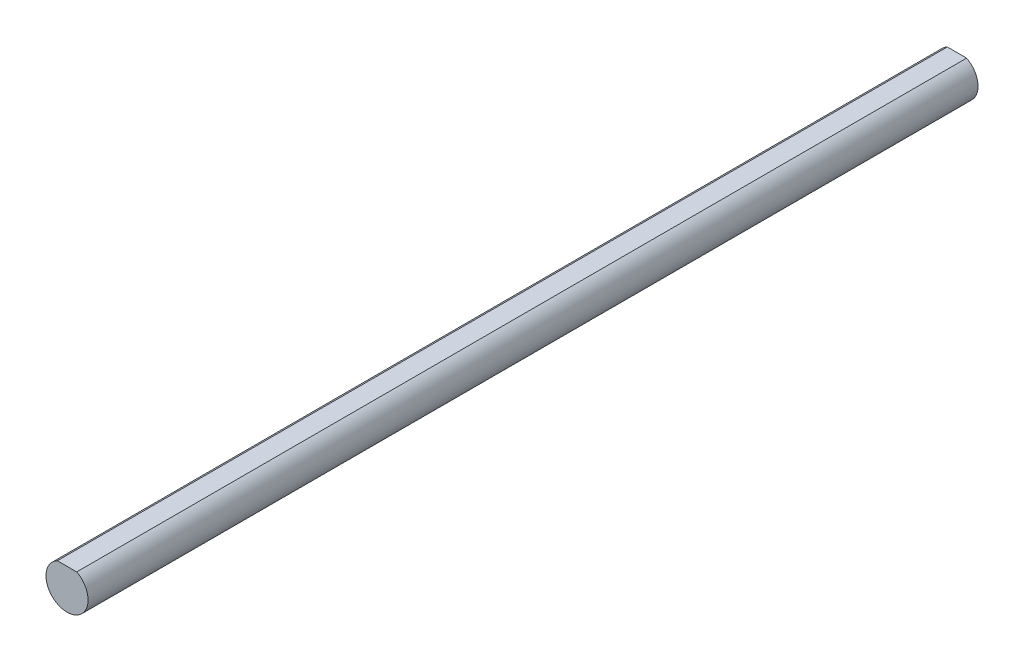
ISO-10303-21;
HEADER;
FILE_DESCRIPTION(('STEP AP214'),'2;1');
FILE_NAME('part.step','',(''),(''),'','','');
FILE_SCHEMA(('AUTOMOTIVE_DESIGN { 1 0 10303 214 1 1 1 1 }'));
ENDSEC;
DATA;
#1=APPLICATION_CONTEXT('core data for automotive mechanical design processes');
#2=APPLICATION_PROTOCOL_DEFINITION('international standard','automotive_design',2000,#1);
#3=PRODUCT_CONTEXT('',#1,'mechanical');
#4=PRODUCT('Part','Part','',(#3));
#5=PRODUCT_RELATED_PRODUCT_CATEGORY('part','',(#4));
#6=PRODUCT_DEFINITION_FORMATION('','',#4);
#7=PRODUCT_DEFINITION_CONTEXT('part definition',#1,'design');
#8=PRODUCT_DEFINITION('design','',#6,#7);
#9=PRODUCT_DEFINITION_SHAPE('','',#8);
#10=(LENGTH_UNIT() NAMED_UNIT(*) SI_UNIT(.MILLI.,.METRE.));
#11=(NAMED_UNIT(*) PLANE_ANGLE_UNIT() SI_UNIT($,.RADIAN.));
#12=(NAMED_UNIT(*) SI_UNIT($,.STERADIAN.) SOLID_ANGLE_UNIT());
#13=UNCERTAINTY_MEASURE_WITH_UNIT(LENGTH_MEASURE(1.E-05),#10,'distance_accuracy_value','');
#14=(GEOMETRIC_REPRESENTATION_CONTEXT(3) GLOBAL_UNCERTAINTY_ASSIGNED_CONTEXT((#13)) GLOBAL_UNIT_ASSIGNED_CONTEXT((#10,
#11,#12)) REPRESENTATION_CONTEXT('',''));
#15=CARTESIAN_POINT('',(0.,0.,0.));
#16=DIRECTION('',(0.,0.,1.));
#17=DIRECTION('',(1.,0.,0.));
#18=AXIS2_PLACEMENT_3D('',#15,#16,#17);
#19=CARTESIAN_POINT('',(0.,0.,-50.));
#20=DIRECTION('',(0.,0.,1.));
#21=DIRECTION('',(1.,0.,0.));
#22=AXIS2_PLACEMENT_3D('',#19,#20,#21);
#23=CYLINDRICAL_SURFACE('',#22,2.365);
#24=CARTESIAN_POINT('',(0.,0.,50.));
#25=DIRECTION('',(0.,0.,1.));
#26=DIRECTION('',(1.,0.,0.));
#27=AXIS2_PLACEMENT_3D('',#24,#25,#26);
#28=CIRCLE('',#27,2.365);
#29=CARTESIAN_POINT('',(-1.08776146282182,2.09999999999994,50.));
#30=VERTEX_POINT('',#29);
#31=CARTESIAN_POINT('',(1.08776146282182,2.09999999999994,50.));
#32=VERTEX_POINT('',#31);
#33=EDGE_CURVE('E61',#30,#32,#28,.T.);
#34=ORIENTED_EDGE('',*,*,#33,.F.);
#35=DIRECTION('',(0.,0.,1.));
#36=VECTOR('',#35,1.);
#37=CARTESIAN_POINT('',(-1.08776146282182,2.09999999999994,-50.));
#38=LINE('',#37,#36);
#39=CARTESIAN_POINT('',(-1.08776146282182,2.09999999999994,-50.));
#40=VERTEX_POINT('',#39);
#41=EDGE_CURVE('E11',#40,#30,#38,.T.);
#42=ORIENTED_EDGE('',*,*,#41,.F.);
#43=CARTESIAN_POINT('',(0.,0.,-50.));
#44=DIRECTION('',(0.,0.,1.));
#45=DIRECTION('',(1.,0.,0.));
#46=AXIS2_PLACEMENT_3D('',#43,#44,#45);
#47=CIRCLE('',#46,2.365);
#48=CARTESIAN_POINT('',(1.08776146282182,2.09999999999994,-50.));
#49=VERTEX_POINT('',#48);
#50=EDGE_CURVE('E65',#40,#49,#47,.T.);
#51=ORIENTED_EDGE('',*,*,#50,.T.);
#52=DIRECTION('',(0.,0.,1.));
#53=VECTOR('',#52,1.);
#54=CARTESIAN_POINT('',(1.08776146282182,2.09999999999994,-50.));
#55=LINE('',#54,#53);
#56=EDGE_CURVE('E35',#49,#32,#55,.T.);
#57=ORIENTED_EDGE('',*,*,#56,.T.);
#58=EDGE_LOOP('',(#34,#42,#51,#57));
#59=FACE_BOUND('',#58,.T.);
#60=ADVANCED_FACE('F32',(#59),#23,.T.);
#61=CARTESIAN_POINT('',(1.08776146282182,2.09999999999994,-50.));
#62=DIRECTION('',(0.,1.,0.));
#63=DIRECTION('',(0.,0.,1.));
#64=AXIS2_PLACEMENT_3D('',#61,#62,#63);
#65=PLANE('',#64);
#66=DIRECTION('',(-1.,0.,0.));
#67=VECTOR('',#66,1.);
#68=CARTESIAN_POINT('',(1.08776146282182,2.09999999999994,50.));
#69=LINE('',#68,#67);
#70=EDGE_CURVE('E58',#32,#30,#69,.T.);
#71=ORIENTED_EDGE('',*,*,#70,.F.);
#72=ORIENTED_EDGE('',*,*,#56,.F.);
#73=DIRECTION('',(-1.,0.,0.));
#74=VECTOR('',#73,1.);
#75=CARTESIAN_POINT('',(1.08776146282182,2.09999999999994,-50.));
#76=LINE('',#75,#74);
#77=EDGE_CURVE('E60',#49,#40,#76,.T.);
#78=ORIENTED_EDGE('',*,*,#77,.T.);
#79=ORIENTED_EDGE('',*,*,#41,.T.);
#80=EDGE_LOOP('',(#71,#72,#78,#79));
#81=FACE_BOUND('',#80,.T.);
#82=ADVANCED_FACE('F56',(#81),#65,.T.);
#83=CARTESIAN_POINT('',(0.,0.,-50.));
#84=DIRECTION('',(0.,0.,1.));
#85=DIRECTION('',(1.,0.,0.));
#86=AXIS2_PLACEMENT_3D('',#83,#84,#85);
#87=PLANE('',#86);
#88=ORIENTED_EDGE('',*,*,#50,.F.);
#89=ORIENTED_EDGE('',*,*,#77,.F.);
#90=EDGE_LOOP('',(#88,#89));
#91=FACE_BOUND('',#90,.T.);
#92=ADVANCED_FACE('F70',(#91),#87,.F.);
#93=CARTESIAN_POINT('',(0.,0.,50.));
#94=DIRECTION('',(0.,0.,1.));
#95=DIRECTION('',(1.,0.,0.));
#96=AXIS2_PLACEMENT_3D('',#93,#94,#95);
#97=PLANE('',#96);
#98=ORIENTED_EDGE('',*,*,#33,.T.);
#99=ORIENTED_EDGE('',*,*,#70,.T.);
#100=EDGE_LOOP('',(#98,#99));
#101=FACE_BOUND('',#100,.T.);
#102=ADVANCED_FACE('F64',(#101),#97,.T.);
#103=CLOSED_SHELL('',(#60,#82,#92,#102));
#104=MANIFOLD_SOLID_BREP('B2',#103);
#105=ADVANCED_BREP_SHAPE_REPRESENTATION('',(#18,#104),#14);
#106=SHAPE_DEFINITION_REPRESENTATION(#9,#105);
ENDSEC;
END-ISO-10303-21;
